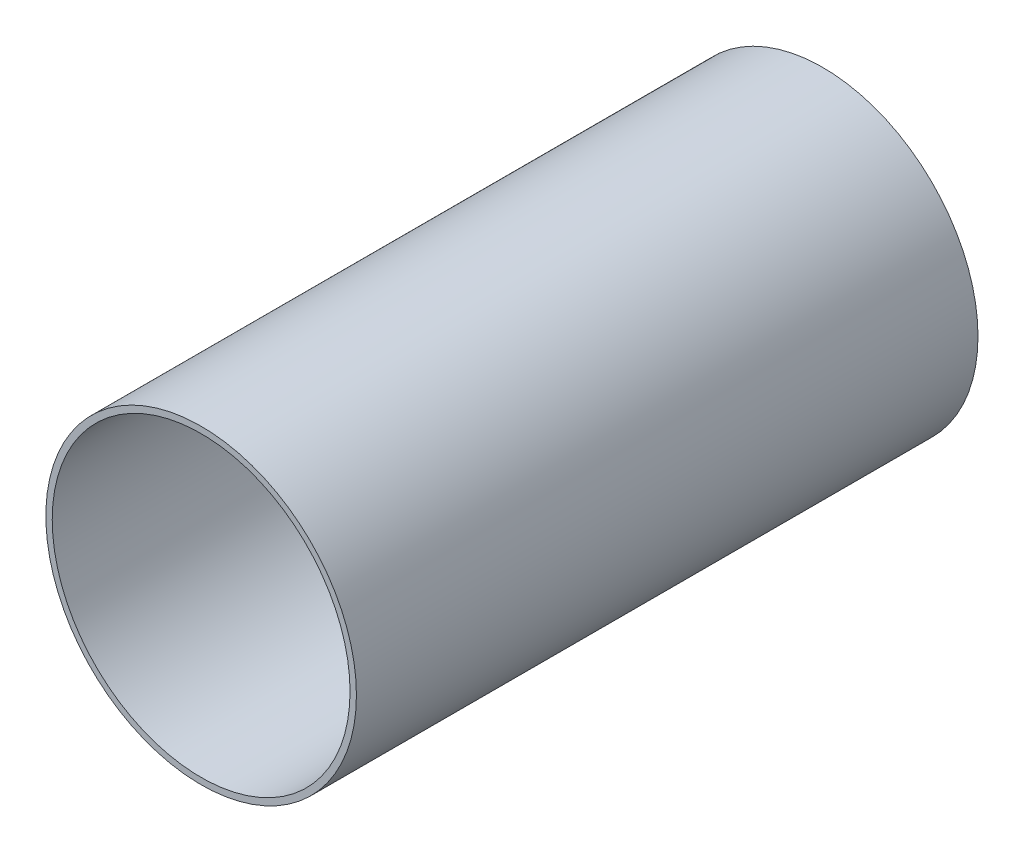
ISO-10303-21;
HEADER;
FILE_DESCRIPTION(('STEP AP214'),'2;1');
FILE_NAME('part.step','',(''),(''),'','','');
FILE_SCHEMA(('AUTOMOTIVE_DESIGN { 1 0 10303 214 1 1 1 1 }'));
ENDSEC;
DATA;
#1=APPLICATION_CONTEXT('core data for automotive mechanical design processes');
#2=APPLICATION_PROTOCOL_DEFINITION('international standard','automotive_design',2000,#1);
#3=PRODUCT_CONTEXT('',#1,'mechanical');
#4=PRODUCT('Part','Part','',(#3));
#5=PRODUCT_RELATED_PRODUCT_CATEGORY('part','',(#4));
#6=PRODUCT_DEFINITION_FORMATION('','',#4);
#7=PRODUCT_DEFINITION_CONTEXT('part definition',#1,'design');
#8=PRODUCT_DEFINITION('design','',#6,#7);
#9=PRODUCT_DEFINITION_SHAPE('','',#8);
#10=(LENGTH_UNIT() NAMED_UNIT(*) SI_UNIT(.MILLI.,.METRE.));
#11=(NAMED_UNIT(*) PLANE_ANGLE_UNIT() SI_UNIT($,.RADIAN.));
#12=(NAMED_UNIT(*) SI_UNIT($,.STERADIAN.) SOLID_ANGLE_UNIT());
#13=UNCERTAINTY_MEASURE_WITH_UNIT(LENGTH_MEASURE(1.E-05),#10,'distance_accuracy_value','');
#14=(GEOMETRIC_REPRESENTATION_CONTEXT(3) GLOBAL_UNCERTAINTY_ASSIGNED_CONTEXT((#13)) GLOBAL_UNIT_ASSIGNED_CONTEXT((#10,
#11,#12)) REPRESENTATION_CONTEXT('',''));
#15=CARTESIAN_POINT('',(0.,0.,0.));
#16=DIRECTION('',(0.,0.,1.));
#17=DIRECTION('',(1.,0.,0.));
#18=AXIS2_PLACEMENT_3D('',#15,#16,#17);
#19=CARTESIAN_POINT('',(0.,0.,76.2));
#20=DIRECTION('',(0.,0.,1.));
#21=DIRECTION('',(1.,0.,0.));
#22=AXIS2_PLACEMENT_3D('',#19,#20,#21);
#23=PLANE('',#22);
#24=CARTESIAN_POINT('',(0.,0.,76.2));
#25=DIRECTION('',(0.,0.,1.));
#26=DIRECTION('',(1.,0.,0.));
#27=AXIS2_PLACEMENT_3D('',#24,#25,#26);
#28=CIRCLE('',#27,38.0746);
#29=CARTESIAN_POINT('',(38.0746,0.,76.2));
#30=VERTEX_POINT('',#29);
#31=EDGE_CURVE('E10',#30,#30,#28,.T.);
#32=ORIENTED_EDGE('',*,*,#31,.T.);
#33=EDGE_LOOP('',(#32));
#34=FACE_BOUND('',#33,.T.);
#35=CARTESIAN_POINT('',(0.,0.,76.2));
#36=DIRECTION('',(0.,0.,1.));
#37=DIRECTION('',(1.,0.,0.));
#38=AXIS2_PLACEMENT_3D('',#35,#36,#37);
#39=CIRCLE('',#38,36.5125);
#40=CARTESIAN_POINT('',(36.5125,0.,76.2));
#41=VERTEX_POINT('',#40);
#42=EDGE_CURVE('E54',#41,#41,#39,.T.);
#43=ORIENTED_EDGE('',*,*,#42,.F.);
#44=EDGE_LOOP('',(#43));
#45=FACE_BOUND('',#44,.T.);
#46=ADVANCED_FACE('F43',(#34,#45),#23,.T.);
#47=CARTESIAN_POINT('',(0.,0.,-76.2));
#48=DIRECTION('',(0.,0.,1.));
#49=DIRECTION('',(1.,0.,0.));
#50=AXIS2_PLACEMENT_3D('',#47,#48,#49);
#51=PLANE('',#50);
#52=CARTESIAN_POINT('',(0.,0.,-76.2));
#53=DIRECTION('',(0.,0.,1.));
#54=DIRECTION('',(1.,0.,0.));
#55=AXIS2_PLACEMENT_3D('',#52,#53,#54);
#56=CIRCLE('',#55,38.0746);
#57=CARTESIAN_POINT('',(38.0746,0.,-76.2));
#58=VERTEX_POINT('',#57);
#59=EDGE_CURVE('E47',#58,#58,#56,.T.);
#60=ORIENTED_EDGE('',*,*,#59,.F.);
#61=EDGE_LOOP('',(#60));
#62=FACE_BOUND('',#61,.T.);
#63=CARTESIAN_POINT('',(0.,0.,-76.2));
#64=DIRECTION('',(0.,0.,1.));
#65=DIRECTION('',(1.,0.,0.));
#66=AXIS2_PLACEMENT_3D('',#63,#64,#65);
#67=CIRCLE('',#66,36.5125);
#68=CARTESIAN_POINT('',(36.5125,0.,-76.2));
#69=VERTEX_POINT('',#68);
#70=EDGE_CURVE('E56',#69,#69,#67,.T.);
#71=ORIENTED_EDGE('',*,*,#70,.T.);
#72=EDGE_LOOP('',(#71));
#73=FACE_BOUND('',#72,.T.);
#74=ADVANCED_FACE('F66',(#62,#73),#51,.F.);
#75=CARTESIAN_POINT('',(0.,0.,76.2));
#76=DIRECTION('',(0.,0.,-1.));
#77=DIRECTION('',(-1.,0.,0.));
#78=AXIS2_PLACEMENT_3D('',#75,#76,#77);
#79=CYLINDRICAL_SURFACE('',#78,38.0746);
#80=ORIENTED_EDGE('',*,*,#31,.F.);
#81=EDGE_LOOP('',(#80));
#82=FACE_BOUND('',#81,.T.);
#83=ORIENTED_EDGE('',*,*,#59,.T.);
#84=EDGE_LOOP('',(#83));
#85=FACE_BOUND('',#84,.T.);
#86=ADVANCED_FACE('F45',(#82,#85),#79,.T.);
#87=CARTESIAN_POINT('',(0.,0.,76.2));
#88=DIRECTION('',(0.,0.,-1.));
#89=DIRECTION('',(-1.,0.,0.));
#90=AXIS2_PLACEMENT_3D('',#87,#88,#89);
#91=CYLINDRICAL_SURFACE('',#90,36.5125);
#92=ORIENTED_EDGE('',*,*,#42,.T.);
#93=EDGE_LOOP('',(#92));
#94=FACE_BOUND('',#93,.T.);
#95=ORIENTED_EDGE('',*,*,#70,.F.);
#96=EDGE_LOOP('',(#95));
#97=FACE_BOUND('',#96,.T.);
#98=ADVANCED_FACE('F62',(#94,#97),#91,.F.);
#99=CLOSED_SHELL('',(#46,#74,#86,#98));
#100=MANIFOLD_SOLID_BREP('B2',#99);
#101=ADVANCED_BREP_SHAPE_REPRESENTATION('',(#18,#100),#14);
#102=SHAPE_DEFINITION_REPRESENTATION(#9,#101);
ENDSEC;
END-ISO-10303-21;
